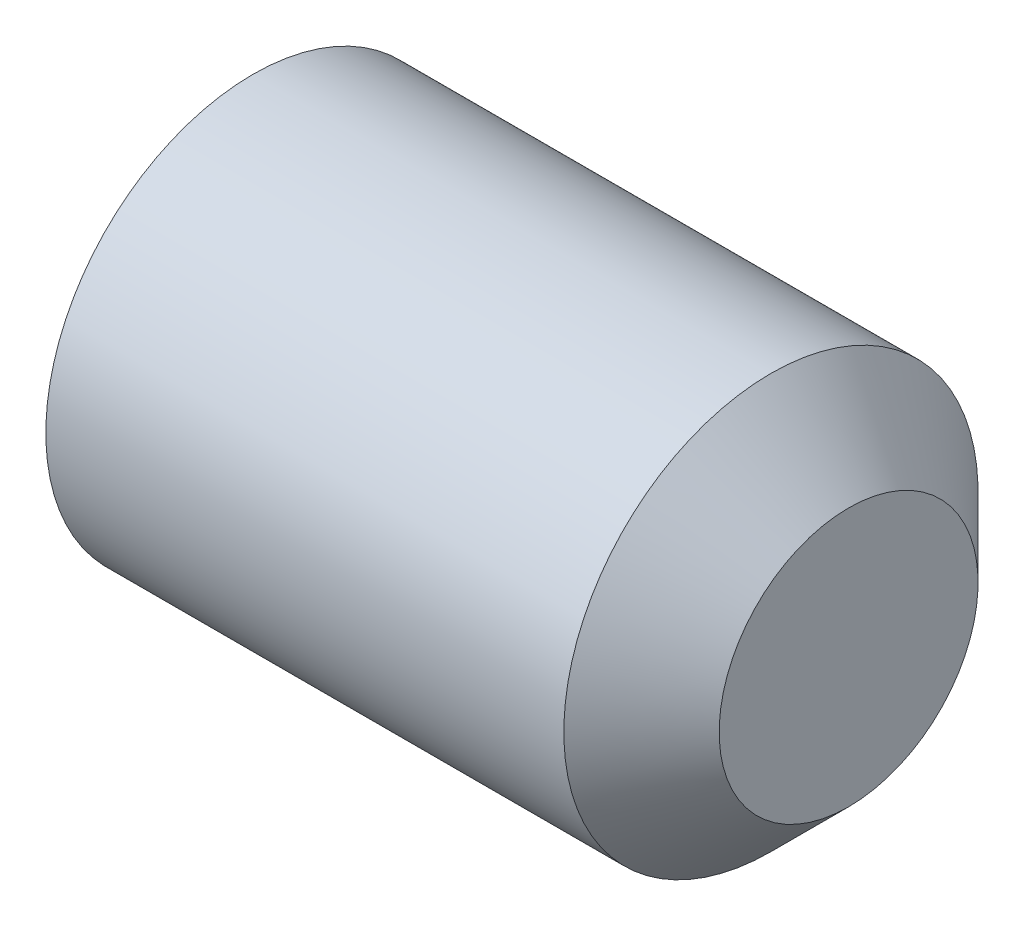
ISO-10303-21;
HEADER;
FILE_DESCRIPTION(('STEP AP214'),'2;1');
FILE_NAME('part.step','',(''),(''),'','','');
FILE_SCHEMA(('AUTOMOTIVE_DESIGN { 1 0 10303 214 1 1 1 1 }'));
ENDSEC;
DATA;
#1=APPLICATION_CONTEXT('core data for automotive mechanical design processes');
#2=APPLICATION_PROTOCOL_DEFINITION('international standard','automotive_design',2000,#1);
#3=PRODUCT_CONTEXT('',#1,'mechanical');
#4=PRODUCT('Part','Part','',(#3));
#5=PRODUCT_RELATED_PRODUCT_CATEGORY('part','',(#4));
#6=PRODUCT_DEFINITION_FORMATION('','',#4);
#7=PRODUCT_DEFINITION_CONTEXT('part definition',#1,'design');
#8=PRODUCT_DEFINITION('design','',#6,#7);
#9=PRODUCT_DEFINITION_SHAPE('','',#8);
#10=(LENGTH_UNIT() NAMED_UNIT(*) SI_UNIT(.MILLI.,.METRE.));
#11=(NAMED_UNIT(*) PLANE_ANGLE_UNIT() SI_UNIT($,.RADIAN.));
#12=(NAMED_UNIT(*) SI_UNIT($,.STERADIAN.) SOLID_ANGLE_UNIT());
#13=UNCERTAINTY_MEASURE_WITH_UNIT(LENGTH_MEASURE(1.E-05),#10,'distance_accuracy_value','');
#14=(GEOMETRIC_REPRESENTATION_CONTEXT(3) GLOBAL_UNCERTAINTY_ASSIGNED_CONTEXT((#13)) GLOBAL_UNIT_ASSIGNED_CONTEXT((#10,
#11,#12)) REPRESENTATION_CONTEXT('',''));
#15=CARTESIAN_POINT('',(0.,0.,0.));
#16=DIRECTION('',(0.,0.,1.));
#17=DIRECTION('',(1.,0.,0.));
#18=AXIS2_PLACEMENT_3D('',#15,#16,#17);
#19=CARTESIAN_POINT('',(0.666666666666667,0.,0.));
#20=DIRECTION('',(-1.,0.,0.));
#21=DIRECTION('',(0.,-1.,0.));
#22=AXIS2_PLACEMENT_3D('',#19,#20,#21);
#23=CONICAL_SURFACE('',#22,0.,1.0471975511966);
#24=CARTESIAN_POINT('',(0.,0.,0.));
#25=DIRECTION('',(-1.,0.,0.));
#26=DIRECTION('',(0.,-1.,0.));
#27=AXIS2_PLACEMENT_3D('',#24,#25,#26);
#28=CIRCLE('',#27,1.15470053837925);
#29=CARTESIAN_POINT('',(0.,0.,1.15470053837925));
#30=VERTEX_POINT('',#29);
#31=CARTESIAN_POINT('',(0.,1.,0.577350269189627));
#32=VERTEX_POINT('',#31);
#33=EDGE_CURVE('E141',#30,#32,#28,.T.);
#34=ORIENTED_EDGE('',*,*,#33,.T.);
#35=CARTESIAN_POINT('',(-6.66766656665943E-05,1.0002,0.577234799135788));
#36=CARTESIAN_POINT('',(0.0145910263508532,0.95625268060172,0.602607795820548));
#37=CARTESIAN_POINT('',(0.0279222763791053,0.91192601605018,0.628199807531658));
#38=CARTESIAN_POINT('',(0.0511934923765451,0.822504925328878,0.679827098330831));
#39=CARTESIAN_POINT('',(0.0611252234502183,0.777408908798268,0.705863295614158));
#40=CARTESIAN_POINT('',(0.0765873051179212,0.687775829477381,0.757612978088368));
#41=CARTESIAN_POINT('',(0.0822205319010469,0.64325256776678,0.783318495222183));
#42=CARTESIAN_POINT('',(0.0889487113597465,0.553996260284982,0.834850648373671));
#43=CARTESIAN_POINT('',(0.0900492320783365,0.509263539518505,0.860677096749781));
#44=CARTESIAN_POINT('',(0.0877749477018623,0.425658889182653,0.90894626412669));
#45=CARTESIAN_POINT('',(0.0849585611365909,0.386774523211233,0.931396163287557));
#46=CARTESIAN_POINT('',(0.07602754978265,0.309259155014813,0.976149681982093));
#47=CARTESIAN_POINT('',(0.0699098662457009,0.27062842143836,0.998453146411451));
#48=CARTESIAN_POINT('',(0.0546142742741775,0.192952883515855,1.04329913914046));
#49=CARTESIAN_POINT('',(0.0453714478310402,0.153917923728832,1.0658359836813));
#50=CARTESIAN_POINT('',(0.0243931542444702,0.0764306187239878,1.11057330008463));
#51=CARTESIAN_POINT('',(0.0126626248663371,0.0379772787061407,1.13277434629517));
#52=CARTESIAN_POINT('',(-6.66766656664239E-05,-0.000199999999999814,1.15481600843309));
#53=B_SPLINE_CURVE_WITH_KNOTS('',3,(#35,#36,#37,#38,#39,#40,#41,#42,#43,#44,#45,#46,#47,#48,#49,
#50,#51,#52),.UNSPECIFIED.,.F.,.F.,(4,2,2,2,2,2,2,2,4),(0.,0.158523820030116,0.317428970089343,
0.472400167924634,0.627180939971649,0.762016584872711,0.896977373984233,1.03493410168667,
1.17261952416172),.UNSPECIFIED.);
#54=EDGE_CURVE('E11',#32,#30,#53,.T.);
#55=ORIENTED_EDGE('',*,*,#54,.T.);
#56=EDGE_LOOP('',(#34,#55));
#57=FACE_BOUND('',#56,.T.);
#58=ADVANCED_FACE('F39',(#57),#23,.F.);
#59=CARTESIAN_POINT('',(0.,-1.,0.577350269189626));
#60=VERTEX_POINT('',#59);
#61=EDGE_CURVE('E137',#60,#30,#28,.T.);
#62=ORIENTED_EDGE('',*,*,#61,.T.);
#63=CARTESIAN_POINT('',(-6.66766656664082E-05,0.0002,1.15481600843309));
#64=CARTESIAN_POINT('',(0.0145910263508534,-0.04374731939828,1.12944301174833));
#65=CARTESIAN_POINT('',(0.0279222763791054,-0.0880739839498204,1.10385100003722));
#66=CARTESIAN_POINT('',(0.0511934923765452,-0.177495074671122,1.05222370923805));
#67=CARTESIAN_POINT('',(0.0611252234502183,-0.222591091201731,1.02618751195472));
#68=CARTESIAN_POINT('',(0.0765873051179213,-0.312224170522619,0.97443782948051));
#69=CARTESIAN_POINT('',(0.082220531901047,-0.35674743223322,0.948732312346695));
#70=CARTESIAN_POINT('',(0.0889487113597467,-0.446003739715018,0.897200159195206));
#71=CARTESIAN_POINT('',(0.0900492320783367,-0.490736460481495,0.871373710819096));
#72=CARTESIAN_POINT('',(0.0877749477018624,-0.574341110817347,0.823104543442188));
#73=CARTESIAN_POINT('',(0.084958561136591,-0.613225476788767,0.80065464428132));
#74=CARTESIAN_POINT('',(0.0760275497826501,-0.690740844985187,0.755901125586784));
#75=CARTESIAN_POINT('',(0.069909866245701,-0.72937157856164,0.733597661157427));
#76=CARTESIAN_POINT('',(0.0546142742741776,-0.807047116484145,0.688751668428419));
#77=CARTESIAN_POINT('',(0.0453714478310403,-0.846082076271168,0.666214823887575));
#78=CARTESIAN_POINT('',(0.0243931542444703,-0.923569381276012,0.62147750748425));
#79=CARTESIAN_POINT('',(0.0126626248663373,-0.962022721293859,0.599276461273706));
#80=CARTESIAN_POINT('',(-6.66766656661424E-05,-1.0002,0.577234799135788));
#81=B_SPLINE_CURVE_WITH_KNOTS('',3,(#63,#64,#65,#66,#67,#68,#69,#70,#71,#72,#73,#74,#75,#76,#77,
#78,#79,#80),.UNSPECIFIED.,.F.,.F.,(4,2,2,2,2,2,2,2,4),(0.,0.158523820030116,0.317428970089343,
0.472400167924634,0.627180939971648,0.762016584872711,0.896977373984233,1.03493410168667,
1.17261952416172),.UNSPECIFIED.);
#82=EDGE_CURVE('E52',#30,#60,#81,.T.);
#83=ORIENTED_EDGE('',*,*,#82,.T.);
#84=EDGE_LOOP('',(#62,#83));
#85=FACE_BOUND('',#84,.T.);
#86=ADVANCED_FACE('F207',(#85),#23,.F.);
#87=CARTESIAN_POINT('',(0.,-1.,-0.577350269189626));
#88=VERTEX_POINT('',#87);
#89=EDGE_CURVE('E136',#88,#60,#28,.T.);
#90=ORIENTED_EDGE('',*,*,#89,.T.);
#91=CARTESIAN_POINT('',(-0.371835288739465,-1.,-1.49514512143373));
#92=CARTESIAN_POINT('',(-0.351115020793431,-1.,-1.45196126115329));
#93=CARTESIAN_POINT('',(-0.330613672349464,-1.,-1.40867282404235));
#94=CARTESIAN_POINT('',(-0.290163433524598,-1.,-1.32182947914247));
#95=CARTESIAN_POINT('',(-0.270214642567288,-1.,-1.27827452509755));
#96=CARTESIAN_POINT('',(-0.211145154836482,-1.,-1.14662339890625));
#97=CARTESIAN_POINT('',(-0.173052526533039,-1.,-1.05805724149108));
#98=CARTESIAN_POINT('',(-0.100245820700573,-1.,-0.876833003172493));
#99=CARTESIAN_POINT('',(-0.0656458404539175,-1.,-0.784128452056493));
#100=CARTESIAN_POINT('',(-0.00407347381845092,-1.,-0.596331746532129));
#101=CARTESIAN_POINT('',(0.0229187151521462,-1.,-0.501246505541255));
#102=CARTESIAN_POINT('',(0.0542242299649826,-1.,-0.356699986452702));
#103=CARTESIAN_POINT('',(0.0631249014530133,-1.,-0.308244163171708));
#104=CARTESIAN_POINT('',(0.0772575682430885,-1.,-0.210788870695442));
#105=CARTESIAN_POINT('',(0.0824898114648207,-1.,-0.161789438465741));
#106=CARTESIAN_POINT('',(0.0888010190182331,-1.,-0.0641060489970652));
#107=CARTESIAN_POINT('',(0.0899289949888954,-1.,-0.0154253461269761));
#108=CARTESIAN_POINT('',(0.0880670216948626,-1.,0.0818553564032764));
#109=CARTESIAN_POINT('',(0.0850768174463906,-1.,0.130455350879703));
#110=CARTESIAN_POINT('',(0.0728816782706968,-1.,0.250369589613779));
#111=CARTESIAN_POINT('',(0.0613914390151105,-1.,0.321451919115028));
#112=CARTESIAN_POINT('',(0.031759682602369,-1.,0.462229038490167));
#113=CARTESIAN_POINT('',(0.0136101490550738,-1.,0.531922048861732));
#114=CARTESIAN_POINT('',(-0.0278697226866449,-1.,0.671415729806804));
#115=CARTESIAN_POINT('',(-0.0513071683069296,-1.,0.741183729418068));
#116=CARTESIAN_POINT('',(-0.101564488246408,-1.,0.879438319396286));
#117=CARTESIAN_POINT('',(-0.128383175230466,-1.,0.947925349932558));
#118=CARTESIAN_POINT('',(-0.200053915473395,-1.,1.12214515906644));
#119=CARTESIAN_POINT('',(-0.246572305198983,-1.,1.22718574040678));
#120=CARTESIAN_POINT('',(-0.342876922247979,-1.,1.43575968104558));
#121=CARTESIAN_POINT('',(-0.392663987822237,-1.,1.53929264533347));
#122=CARTESIAN_POINT('',(-0.494336444534637,-1.,1.74546702338821));
#123=CARTESIAN_POINT('',(-0.546224181866973,-1.,1.84810727553998));
#124=CARTESIAN_POINT('',(-0.651338368835224,-1.,2.05270058021726));
#125=CARTESIAN_POINT('',(-0.704564862672332,-1.,2.15465360991172));
#126=CARTESIAN_POINT('',(-0.806866916911202,-1.,2.34846553091283));
#127=CARTESIAN_POINT('',(-0.855859658964038,-1.,2.44036823161571));
#128=CARTESIAN_POINT('',(-0.954403132828212,-1.,2.623877990053));
#129=CARTESIAN_POINT('',(-1.00395388528949,-1.,2.71548503668386));
#130=CARTESIAN_POINT('',(-1.10334710767982,-1.,2.89823865557592));
#131=CARTESIAN_POINT('',(-1.15318851504101,-1.,2.98938580641155));
#132=CARTESIAN_POINT('',(-1.25319572337612,-1.,3.17149583112621));
#133=CARTESIAN_POINT('',(-1.30336150723715,-1.,3.26245871439934));
#134=CARTESIAN_POINT('',(-1.35364621220496,-1.,3.35335539208175));
#135=B_SPLINE_CURVE_WITH_KNOTS('',3,(#91,#92,#93,#94,#95,#96,#97,#98,#99,#100,#101,#102,#103,
#104,#105,#106,#107,#108,#109,#110,#111,#112,#113,#114,#115,#116,#117,#118,#119,#120,#121,#122,
#123,#124,#125,#126,#127,#128,#129,#130,#131,#132,#133,#134),.UNSPECIFIED.,.F.,.F.,(4,2,2,2,2,2,
2,2,2,2,2,2,2,2,2,2,2,2,2,2,2,4),(0.,0.143690341820649,0.287406372566271,0.576560332877487,
0.873259488934024,1.16917907000005,1.31686338831956,1.46453772487642,1.61044269221658,
1.75635669390451,1.97192533331897,2.18775432802312,2.40842600301164,2.62902040304934,
2.97355048126457,3.31816926186282,3.66318417395129,4.00821049225241,4.32064609598595,
4.63309330006987,4.94474578248759,5.25638195528639),.UNSPECIFIED.);
#136=EDGE_CURVE('E183',#60,#88,#135,.F.);
#137=ORIENTED_EDGE('',*,*,#136,.T.);
#138=EDGE_LOOP('',(#90,#137));
#139=FACE_BOUND('',#138,.T.);
#140=ADVANCED_FACE('F213',(#139),#23,.F.);
#141=CARTESIAN_POINT('',(0.,0.,-1.15470053837925));
#142=VERTEX_POINT('',#141);
#143=EDGE_CURVE('E235',#142,#88,#28,.T.);
#144=ORIENTED_EDGE('',*,*,#143,.T.);
#145=CARTESIAN_POINT('',(-6.66766656663955E-05,-1.0002,-0.577234799135788));
#146=CARTESIAN_POINT('',(0.0145910263508534,-0.95625268060172,-0.602607795820547));
#147=CARTESIAN_POINT('',(0.0279222763791054,-0.91192601605018,-0.628199807531658));
#148=CARTESIAN_POINT('',(0.0511934923765452,-0.822504925328878,-0.679827098330831));
#149=CARTESIAN_POINT('',(0.0611252234502184,-0.777408908798268,-0.705863295614158));
#150=CARTESIAN_POINT('',(0.0765873051179213,-0.687775829477381,-0.757612978088368));
#151=CARTESIAN_POINT('',(0.0822205319010469,-0.64325256776678,-0.783318495222183));
#152=CARTESIAN_POINT('',(0.0889487113597466,-0.553996260284982,-0.834850648373671));
#153=CARTESIAN_POINT('',(0.0900492320783365,-0.509263539518505,-0.860677096749781));
#154=CARTESIAN_POINT('',(0.0877749477018624,-0.425658889182653,-0.90894626412669));
#155=CARTESIAN_POINT('',(0.084958561136591,-0.386774523211233,-0.931396163287557));
#156=CARTESIAN_POINT('',(0.0760275497826501,-0.309259155014813,-0.976149681982093));
#157=CARTESIAN_POINT('',(0.0699098662457009,-0.27062842143836,-0.998453146411451));
#158=CARTESIAN_POINT('',(0.0546142742741775,-0.192952883515855,-1.04329913914046));
#159=CARTESIAN_POINT('',(0.0453714478310403,-0.153917923728832,-1.0658359836813));
#160=CARTESIAN_POINT('',(0.0243931542444704,-0.0764306187239879,-1.11057330008463));
#161=CARTESIAN_POINT('',(0.0126626248663374,-0.0379772787061409,-1.13277434629517));
#162=CARTESIAN_POINT('',(-6.66766656664534E-05,0.000199999999999809,-1.15481600843309));
#163=B_SPLINE_CURVE_WITH_KNOTS('',3,(#145,#146,#147,#148,#149,#150,#151,#152,#153,#154,#155,
#156,#157,#158,#159,#160,#161,#162),.UNSPECIFIED.,.F.,.F.,(4,2,2,2,2,2,2,2,4),(0.,
0.158523820030115,0.317428970089343,0.472400167924634,0.627180939971649,0.762016584872711,
0.896977373984233,1.03493410168667,1.17261952416172),.UNSPECIFIED.);
#164=EDGE_CURVE('E178',#88,#142,#163,.T.);
#165=ORIENTED_EDGE('',*,*,#164,.T.);
#166=EDGE_LOOP('',(#144,#165));
#167=FACE_BOUND('',#166,.T.);
#168=ADVANCED_FACE('F225',(#167),#23,.F.);
#169=CARTESIAN_POINT('',(0.,1.,-0.577350269189626));
#170=VERTEX_POINT('',#169);
#171=EDGE_CURVE('E233',#170,#142,#28,.T.);
#172=ORIENTED_EDGE('',*,*,#171,.T.);
#173=CARTESIAN_POINT('',(-6.66766656664082E-05,-0.0002,-1.15481600843309));
#174=CARTESIAN_POINT('',(0.0145910263508535,0.0437473193982801,-1.12944301174833));
#175=CARTESIAN_POINT('',(0.0279222763791055,0.0880739839498204,-1.10385100003722));
#176=CARTESIAN_POINT('',(0.0511934923765453,0.177495074671122,-1.05222370923805));
#177=CARTESIAN_POINT('',(0.0611252234502184,0.222591091201731,-1.02618751195472));
#178=CARTESIAN_POINT('',(0.0765873051179213,0.312224170522619,-0.97443782948051));
#179=CARTESIAN_POINT('',(0.082220531901047,0.35674743223322,-0.948732312346695));
#180=CARTESIAN_POINT('',(0.0889487113597467,0.446003739715018,-0.897200159195206));
#181=CARTESIAN_POINT('',(0.0900492320783367,0.490736460481495,-0.871373710819096));
#182=CARTESIAN_POINT('',(0.0877749477018624,0.574341110817347,-0.823104543442188));
#183=CARTESIAN_POINT('',(0.084958561136591,0.613225476788767,-0.80065464428132));
#184=CARTESIAN_POINT('',(0.0760275497826501,0.690740844985187,-0.755901125586784));
#185=CARTESIAN_POINT('',(0.0699098662457009,0.72937157856164,-0.733597661157427));
#186=CARTESIAN_POINT('',(0.0546142742741775,0.807047116484145,-0.688751668428419));
#187=CARTESIAN_POINT('',(0.0453714478310403,0.846082076271168,-0.666214823887575));
#188=CARTESIAN_POINT('',(0.0243931542444703,0.923569381276012,-0.62147750748425));
#189=CARTESIAN_POINT('',(0.0126626248663373,0.962022721293859,-0.599276461273706));
#190=CARTESIAN_POINT('',(-6.66766656663592E-05,1.0002,-0.577234799135788));
#191=B_SPLINE_CURVE_WITH_KNOTS('',3,(#173,#174,#175,#176,#177,#178,#179,#180,#181,#182,#183,
#184,#185,#186,#187,#188,#189,#190),.UNSPECIFIED.,.F.,.F.,(4,2,2,2,2,2,2,2,4),(0.,
0.158523820030116,0.317428970089343,0.472400167924634,0.627180939971648,0.762016584872711,
0.896977373984233,1.03493410168667,1.17261952416172),.UNSPECIFIED.);
#192=EDGE_CURVE('E119',#142,#170,#191,.T.);
#193=ORIENTED_EDGE('',*,*,#192,.T.);
#194=EDGE_LOOP('',(#172,#193));
#195=FACE_BOUND('',#194,.T.);
#196=ADVANCED_FACE('F217',(#195),#23,.F.);
#197=EDGE_CURVE('E229',#32,#170,#28,.T.);
#198=ORIENTED_EDGE('',*,*,#197,.T.);
#199=CARTESIAN_POINT('',(-0.371835288739465,1.,-1.49514512143373));
#200=CARTESIAN_POINT('',(-0.351115020793431,1.,-1.45196126115329));
#201=CARTESIAN_POINT('',(-0.330613672349464,1.,-1.40867282404235));
#202=CARTESIAN_POINT('',(-0.290163433524598,1.,-1.32182947914247));
#203=CARTESIAN_POINT('',(-0.270214642567288,1.,-1.27827452509755));
#204=CARTESIAN_POINT('',(-0.211145154836482,1.,-1.14662339890624));
#205=CARTESIAN_POINT('',(-0.173052526533039,1.,-1.05805724149108));
#206=CARTESIAN_POINT('',(-0.100245820700573,1.,-0.876833003172492));
#207=CARTESIAN_POINT('',(-0.0656458404539175,1.,-0.784128452056492));
#208=CARTESIAN_POINT('',(-0.004073473818451,1.,-0.596331746532129));
#209=CARTESIAN_POINT('',(0.0229187151521459,1.,-0.501246505541255));
#210=CARTESIAN_POINT('',(0.0542242299649824,1.,-0.356699986452702));
#211=CARTESIAN_POINT('',(0.0631249014530132,1.,-0.308244163171708));
#212=CARTESIAN_POINT('',(0.0772575682430884,1.,-0.210788870695442));
#213=CARTESIAN_POINT('',(0.0824898114648206,1.,-0.161789438465741));
#214=CARTESIAN_POINT('',(0.0888010190182329,1.,-0.0641060489970652));
#215=CARTESIAN_POINT('',(0.0899289949888951,1.,-0.015425346126976));
#216=CARTESIAN_POINT('',(0.0880670216948623,1.,0.0818553564032765));
#217=CARTESIAN_POINT('',(0.0850768174463904,1.,0.130455350879703));
#218=CARTESIAN_POINT('',(0.0728816782706966,1.,0.250369589613779));
#219=CARTESIAN_POINT('',(0.0613914390151103,1.,0.321451919115028));
#220=CARTESIAN_POINT('',(0.0317596826023687,1.,0.462229038490167));
#221=CARTESIAN_POINT('',(0.0136101490550734,1.,0.531922048861732));
#222=CARTESIAN_POINT('',(-0.0278697226866453,1.,0.671415729806804));
#223=CARTESIAN_POINT('',(-0.0513071683069298,1.,0.741183729418069));
#224=CARTESIAN_POINT('',(-0.101564488246408,1.,0.879438319396286));
#225=CARTESIAN_POINT('',(-0.128383175230466,1.,0.947925349932558));
#226=CARTESIAN_POINT('',(-0.200053915473395,1.,1.12214515906644));
#227=CARTESIAN_POINT('',(-0.246572305198983,1.,1.22718574040677));
#228=CARTESIAN_POINT('',(-0.342876922247979,1.,1.43575968104557));
#229=CARTESIAN_POINT('',(-0.392663987822236,1.,1.53929264533347));
#230=CARTESIAN_POINT('',(-0.494336444534637,1.,1.74546702338821));
#231=CARTESIAN_POINT('',(-0.546224181866972,1.,1.84810727553998));
#232=CARTESIAN_POINT('',(-0.651338368835222,1.,2.05270058021726));
#233=CARTESIAN_POINT('',(-0.70456486267233,1.,2.15465360991172));
#234=CARTESIAN_POINT('',(-0.806866916911201,1.,2.34846553091283));
#235=CARTESIAN_POINT('',(-0.855859658964037,1.,2.4403682316157));
#236=CARTESIAN_POINT('',(-0.954403132828211,1.,2.623877990053));
#237=CARTESIAN_POINT('',(-1.00395388528949,1.,2.71548503668386));
#238=CARTESIAN_POINT('',(-1.10334710767982,1.,2.89823865557592));
#239=CARTESIAN_POINT('',(-1.15318851504101,1.,2.98938580641155));
#240=CARTESIAN_POINT('',(-1.25319572337612,1.,3.17149583112621));
#241=CARTESIAN_POINT('',(-1.30336150723715,1.,3.26245871439934));
#242=CARTESIAN_POINT('',(-1.35364621220496,1.,3.35335539208175));
#243=B_SPLINE_CURVE_WITH_KNOTS('',3,(#199,#200,#201,#202,#203,#204,#205,#206,#207,#208,#209,
#210,#211,#212,#213,#214,#215,#216,#217,#218,#219,#220,#221,#222,#223,#224,#225,#226,#227,#228,
#229,#230,#231,#232,#233,#234,#235,#236,#237,#238,#239,#240,#241,#242),.UNSPECIFIED.,.F.,.F.,(4,
2,2,2,2,2,2,2,2,2,2,2,2,2,2,2,2,2,2,2,2,4),(0.,0.143690341820648,0.28740637256627,
0.576560332877487,0.873259488934024,1.16917907000005,1.31686338831956,1.46453772487641,
1.61044269221658,1.75635669390451,1.97192533331897,2.18775432802312,2.40842600301164,
2.62902040304934,2.97355048126457,3.31816926186282,3.66318417395129,4.00821049225241,
4.32064609598595,4.63309330006986,4.94474578248759,5.25638195528639),.UNSPECIFIED.);
#244=EDGE_CURVE('E85',#170,#32,#243,.T.);
#245=ORIENTED_EDGE('',*,*,#244,.T.);
#246=EDGE_LOOP('',(#198,#245));
#247=FACE_BOUND('',#246,.T.);
#248=ADVANCED_FACE('F209',(#247),#23,.F.);
#249=CARTESIAN_POINT('',(6.,0.,0.));
#250=DIRECTION('',(1.,0.,0.));
#251=DIRECTION('',(0.,1.,0.));
#252=AXIS2_PLACEMENT_3D('',#249,#250,#251);
#253=PLANE('',#252);
#254=CARTESIAN_POINT('',(6.,0.,0.));
#255=DIRECTION('',(-1.,0.,0.));
#256=DIRECTION('',(0.,-1.,0.));
#257=AXIS2_PLACEMENT_3D('',#254,#255,#256);
#258=CIRCLE('',#257,1.25);
#259=CARTESIAN_POINT('',(6.,-1.25,0.));
#260=VERTEX_POINT('',#259);
#261=EDGE_CURVE('E150',#260,#260,#258,.T.);
#262=ORIENTED_EDGE('',*,*,#261,.F.);
#263=EDGE_LOOP('',(#262));
#264=FACE_BOUND('',#263,.T.);
#265=ADVANCED_FACE('F41',(#264),#253,.T.);
#266=CARTESIAN_POINT('',(5.25,0.,0.));
#267=DIRECTION('',(-1.,0.,0.));
#268=DIRECTION('',(0.,-1.,0.));
#269=AXIS2_PLACEMENT_3D('',#266,#267,#268);
#270=CONICAL_SURFACE('',#269,2.,0.785398163397449);
#271=ORIENTED_EDGE('',*,*,#261,.T.);
#272=EDGE_LOOP('',(#271));
#273=FACE_BOUND('',#272,.T.);
#274=CARTESIAN_POINT('',(5.25,0.,0.));
#275=DIRECTION('',(-1.,0.,0.));
#276=DIRECTION('',(0.,-1.,0.));
#277=AXIS2_PLACEMENT_3D('',#274,#275,#276);
#278=CIRCLE('',#277,2.);
#279=CARTESIAN_POINT('',(5.25,-2.,0.));
#280=VERTEX_POINT('',#279);
#281=EDGE_CURVE('E147',#280,#280,#278,.T.);
#282=ORIENTED_EDGE('',*,*,#281,.F.);
#283=EDGE_LOOP('',(#282));
#284=FACE_BOUND('',#283,.T.);
#285=ADVANCED_FACE('F223',(#273,#284),#270,.T.);
#286=CARTESIAN_POINT('',(0.666666666666667,0.,0.));
#287=DIRECTION('',(-1.,0.,0.));
#288=DIRECTION('',(0.,-1.,0.));
#289=AXIS2_PLACEMENT_3D('',#286,#287,#288);
#290=CYLINDRICAL_SURFACE('',#289,2.);
#291=ORIENTED_EDGE('',*,*,#281,.T.);
#292=EDGE_LOOP('',(#291));
#293=FACE_BOUND('',#292,.T.);
#294=CARTESIAN_POINT('',(0.247971940616944,0.,0.));
#295=DIRECTION('',(-1.,0.,0.));
#296=DIRECTION('',(0.,-1.,0.));
#297=AXIS2_PLACEMENT_3D('',#294,#295,#296);
#298=CIRCLE('',#297,2.);
#299=CARTESIAN_POINT('',(0.247971940616944,-2.,0.));
#300=VERTEX_POINT('',#299);
#301=EDGE_CURVE('E144',#300,#300,#298,.T.);
#302=ORIENTED_EDGE('',*,*,#301,.F.);
#303=EDGE_LOOP('',(#302));
#304=FACE_BOUND('',#303,.T.);
#305=ADVANCED_FACE('F276',(#293,#304),#290,.T.);
#306=CARTESIAN_POINT('',(0.,0.,0.));
#307=DIRECTION('',(1.,0.,0.));
#308=DIRECTION('',(0.,1.,0.));
#309=AXIS2_PLACEMENT_3D('',#306,#307,#308);
#310=CONICAL_SURFACE('',#309,1.5705,1.0471975511966);
#311=ORIENTED_EDGE('',*,*,#301,.T.);
#312=EDGE_LOOP('',(#311));
#313=FACE_BOUND('',#312,.T.);
#314=CARTESIAN_POINT('',(0.,0.,0.));
#315=DIRECTION('',(-1.,0.,0.));
#316=DIRECTION('',(0.,-1.,0.));
#317=AXIS2_PLACEMENT_3D('',#314,#315,#316);
#318=CIRCLE('',#317,1.5705);
#319=CARTESIAN_POINT('',(0.,-1.5705,0.));
#320=VERTEX_POINT('',#319);
#321=EDGE_CURVE('E140',#320,#320,#318,.T.);
#322=ORIENTED_EDGE('',*,*,#321,.F.);
#323=EDGE_LOOP('',(#322));
#324=FACE_BOUND('',#323,.T.);
#325=ADVANCED_FACE('F204',(#313,#324),#310,.T.);
#326=CARTESIAN_POINT('',(0.,-1.5705,0.));
#327=DIRECTION('',(-1.,0.,0.));
#328=DIRECTION('',(0.,-1.,0.));
#329=AXIS2_PLACEMENT_3D('',#326,#327,#328);
#330=PLANE('',#329);
#331=ORIENTED_EDGE('',*,*,#321,.T.);
#332=EDGE_LOOP('',(#331));
#333=FACE_BOUND('',#332,.T.);
#334=ORIENTED_EDGE('',*,*,#61,.F.);
#335=ORIENTED_EDGE('',*,*,#89,.F.);
#336=ORIENTED_EDGE('',*,*,#143,.F.);
#337=ORIENTED_EDGE('',*,*,#171,.F.);
#338=ORIENTED_EDGE('',*,*,#197,.F.);
#339=ORIENTED_EDGE('',*,*,#33,.F.);
#340=EDGE_LOOP('',(#334,#335,#336,#337,#338,#339));
#341=FACE_BOUND('',#340,.T.);
#342=ADVANCED_FACE('F199',(#333,#341),#330,.T.);
#343=CARTESIAN_POINT('',(2.5,1.,0.577350269189626));
#344=DIRECTION('',(0.,-0.5,-0.866025403784439));
#345=DIRECTION('',(0.,0.866025403784439,-0.5));
#346=AXIS2_PLACEMENT_3D('',#343,#344,#345);
#347=PLANE('',#346);
#348=DIRECTION('',(-1.,0.,0.));
#349=VECTOR('',#348,1.);
#350=CARTESIAN_POINT('',(2.5,1.,0.577350269189626));
#351=LINE('',#350,#349);
#352=CARTESIAN_POINT('',(2.5,1.,0.577350269189626));
#353=VERTEX_POINT('',#352);
#354=EDGE_CURVE('E59',#353,#32,#351,.T.);
#355=ORIENTED_EDGE('',*,*,#354,.F.);
#356=DIRECTION('',(0.,-0.866025403784439,0.5));
#357=VECTOR('',#356,1.);
#358=CARTESIAN_POINT('',(2.5,1.,0.577350269189626));
#359=LINE('',#358,#357);
#360=CARTESIAN_POINT('',(2.5,0.,1.15470053837925));
#361=VERTEX_POINT('',#360);
#362=EDGE_CURVE('E245',#353,#361,#359,.T.);
#363=ORIENTED_EDGE('',*,*,#362,.T.);
#364=DIRECTION('',(-1.,0.,0.));
#365=VECTOR('',#364,1.);
#366=CARTESIAN_POINT('',(2.5,0.,1.15470053837925));
#367=LINE('',#366,#365);
#368=EDGE_CURVE('E133',#361,#30,#367,.T.);
#369=ORIENTED_EDGE('',*,*,#368,.T.);
#370=ORIENTED_EDGE('',*,*,#54,.F.);
#371=EDGE_LOOP('',(#355,#363,#369,#370));
#372=FACE_BOUND('',#371,.T.);
#373=ADVANCED_FACE('F195',(#372),#347,.T.);
#374=CARTESIAN_POINT('',(2.5,0.,1.15470053837925));
#375=DIRECTION('',(0.,0.5,-0.866025403784439));
#376=DIRECTION('',(0.,0.866025403784439,0.5));
#377=AXIS2_PLACEMENT_3D('',#374,#375,#376);
#378=PLANE('',#377);
#379=ORIENTED_EDGE('',*,*,#368,.F.);
#380=DIRECTION('',(0.,-0.866025403784439,-0.5));
#381=VECTOR('',#380,1.);
#382=CARTESIAN_POINT('',(2.5,0.,1.15470053837925));
#383=LINE('',#382,#381);
#384=CARTESIAN_POINT('',(2.5,-1.,0.577350269189626));
#385=VERTEX_POINT('',#384);
#386=EDGE_CURVE('E94',#361,#385,#383,.T.);
#387=ORIENTED_EDGE('',*,*,#386,.T.);
#388=DIRECTION('',(-1.,0.,0.));
#389=VECTOR('',#388,1.);
#390=CARTESIAN_POINT('',(2.5,-1.,0.577350269189626));
#391=LINE('',#390,#389);
#392=EDGE_CURVE('E130',#385,#60,#391,.T.);
#393=ORIENTED_EDGE('',*,*,#392,.T.);
#394=ORIENTED_EDGE('',*,*,#82,.F.);
#395=EDGE_LOOP('',(#379,#387,#393,#394));
#396=FACE_BOUND('',#395,.T.);
#397=ADVANCED_FACE('F192',(#396),#378,.T.);
#398=CARTESIAN_POINT('',(2.5,-1.,0.577350269189626));
#399=DIRECTION('',(0.,1.,0.));
#400=DIRECTION('',(0.,0.,1.));
#401=AXIS2_PLACEMENT_3D('',#398,#399,#400);
#402=PLANE('',#401);
#403=ORIENTED_EDGE('',*,*,#392,.F.);
#404=DIRECTION('',(0.,0.,-1.));
#405=VECTOR('',#404,1.);
#406=CARTESIAN_POINT('',(2.5,-1.,0.577350269189626));
#407=LINE('',#406,#405);
#408=CARTESIAN_POINT('',(2.5,-1.,-0.577350269189626));
#409=VERTEX_POINT('',#408);
#410=EDGE_CURVE('E114',#385,#409,#407,.T.);
#411=ORIENTED_EDGE('',*,*,#410,.T.);
#412=DIRECTION('',(-1.,0.,0.));
#413=VECTOR('',#412,1.);
#414=CARTESIAN_POINT('',(2.5,-1.,-0.577350269189626));
#415=LINE('',#414,#413);
#416=EDGE_CURVE('E111',#409,#88,#415,.T.);
#417=ORIENTED_EDGE('',*,*,#416,.T.);
#418=ORIENTED_EDGE('',*,*,#136,.F.);
#419=EDGE_LOOP('',(#403,#411,#417,#418));
#420=FACE_BOUND('',#419,.T.);
#421=ADVANCED_FACE('F175',(#420),#402,.T.);
#422=CARTESIAN_POINT('',(2.5,-1.,-0.577350269189626));
#423=DIRECTION('',(0.,0.5,0.866025403784439));
#424=DIRECTION('',(0.,-0.866025403784439,0.5));
#425=AXIS2_PLACEMENT_3D('',#422,#423,#424);
#426=PLANE('',#425);
#427=ORIENTED_EDGE('',*,*,#416,.F.);
#428=DIRECTION('',(0.,0.866025403784439,-0.5));
#429=VECTOR('',#428,1.);
#430=CARTESIAN_POINT('',(2.5,-1.,-0.577350269189626));
#431=LINE('',#430,#429);
#432=CARTESIAN_POINT('',(2.5,0.,-1.15470053837925));
#433=VERTEX_POINT('',#432);
#434=EDGE_CURVE('E105',#409,#433,#431,.T.);
#435=ORIENTED_EDGE('',*,*,#434,.T.);
#436=DIRECTION('',(-1.,0.,0.));
#437=VECTOR('',#436,1.);
#438=CARTESIAN_POINT('',(2.5,0.,-1.15470053837925));
#439=LINE('',#438,#437);
#440=EDGE_CURVE('E108',#433,#142,#439,.T.);
#441=ORIENTED_EDGE('',*,*,#440,.T.);
#442=ORIENTED_EDGE('',*,*,#164,.F.);
#443=EDGE_LOOP('',(#427,#435,#441,#442));
#444=FACE_BOUND('',#443,.T.);
#445=ADVANCED_FACE('F107',(#444),#426,.T.);
#446=CARTESIAN_POINT('',(2.5,0.,-1.15470053837925));
#447=DIRECTION('',(0.,-0.5,0.866025403784439));
#448=DIRECTION('',(0.,-0.866025403784439,-0.5));
#449=AXIS2_PLACEMENT_3D('',#446,#447,#448);
#450=PLANE('',#449);
#451=ORIENTED_EDGE('',*,*,#440,.F.);
#452=DIRECTION('',(0.,0.866025403784439,0.5));
#453=VECTOR('',#452,1.);
#454=CARTESIAN_POINT('',(2.5,0.,-1.15470053837925));
#455=LINE('',#454,#453);
#456=CARTESIAN_POINT('',(2.5,1.,-0.577350269189626));
#457=VERTEX_POINT('',#456);
#458=EDGE_CURVE('E113',#433,#457,#455,.T.);
#459=ORIENTED_EDGE('',*,*,#458,.T.);
#460=DIRECTION('',(-1.,0.,0.));
#461=VECTOR('',#460,1.);
#462=CARTESIAN_POINT('',(2.5,1.,-0.577350269189626));
#463=LINE('',#462,#461);
#464=EDGE_CURVE('E120',#457,#170,#463,.T.);
#465=ORIENTED_EDGE('',*,*,#464,.T.);
#466=ORIENTED_EDGE('',*,*,#192,.F.);
#467=EDGE_LOOP('',(#451,#459,#465,#466));
#468=FACE_BOUND('',#467,.T.);
#469=ADVANCED_FACE('F117',(#468),#450,.T.);
#470=CARTESIAN_POINT('',(2.5,1.,-0.577350269189626));
#471=DIRECTION('',(0.,-1.,0.));
#472=DIRECTION('',(0.,0.,-1.));
#473=AXIS2_PLACEMENT_3D('',#470,#471,#472);
#474=PLANE('',#473);
#475=ORIENTED_EDGE('',*,*,#464,.F.);
#476=DIRECTION('',(0.,0.,1.));
#477=VECTOR('',#476,1.);
#478=CARTESIAN_POINT('',(2.5,1.,-0.577350269189626));
#479=LINE('',#478,#477);
#480=EDGE_CURVE('E65',#457,#353,#479,.T.);
#481=ORIENTED_EDGE('',*,*,#480,.T.);
#482=ORIENTED_EDGE('',*,*,#354,.T.);
#483=ORIENTED_EDGE('',*,*,#244,.F.);
#484=EDGE_LOOP('',(#475,#481,#482,#483));
#485=FACE_BOUND('',#484,.T.);
#486=ADVANCED_FACE('F165',(#485),#474,.T.);
#487=CARTESIAN_POINT('',(2.5,0.,0.));
#488=DIRECTION('',(1.,0.,0.));
#489=DIRECTION('',(0.,0.,-1.));
#490=AXIS2_PLACEMENT_3D('',#487,#488,#489);
#491=PLANE('',#490);
#492=ORIENTED_EDGE('',*,*,#362,.F.);
#493=ORIENTED_EDGE('',*,*,#480,.F.);
#494=ORIENTED_EDGE('',*,*,#458,.F.);
#495=ORIENTED_EDGE('',*,*,#434,.F.);
#496=ORIENTED_EDGE('',*,*,#410,.F.);
#497=ORIENTED_EDGE('',*,*,#386,.F.);
#498=EDGE_LOOP('',(#492,#493,#494,#495,#496,#497));
#499=FACE_BOUND('',#498,.T.);
#500=ADVANCED_FACE('F122',(#499),#491,.F.);
#501=CLOSED_SHELL('',(#58,#86,#140,#168,#196,#248,#265,#285,#305,#325,#342,#373,#397,#421,#445,
#469,#486,#500));
#502=MANIFOLD_SOLID_BREP('B2',#501);
#503=ADVANCED_BREP_SHAPE_REPRESENTATION('',(#18,#502),#14);
#504=SHAPE_DEFINITION_REPRESENTATION(#9,#503);
ENDSEC;
END-ISO-10303-21;
